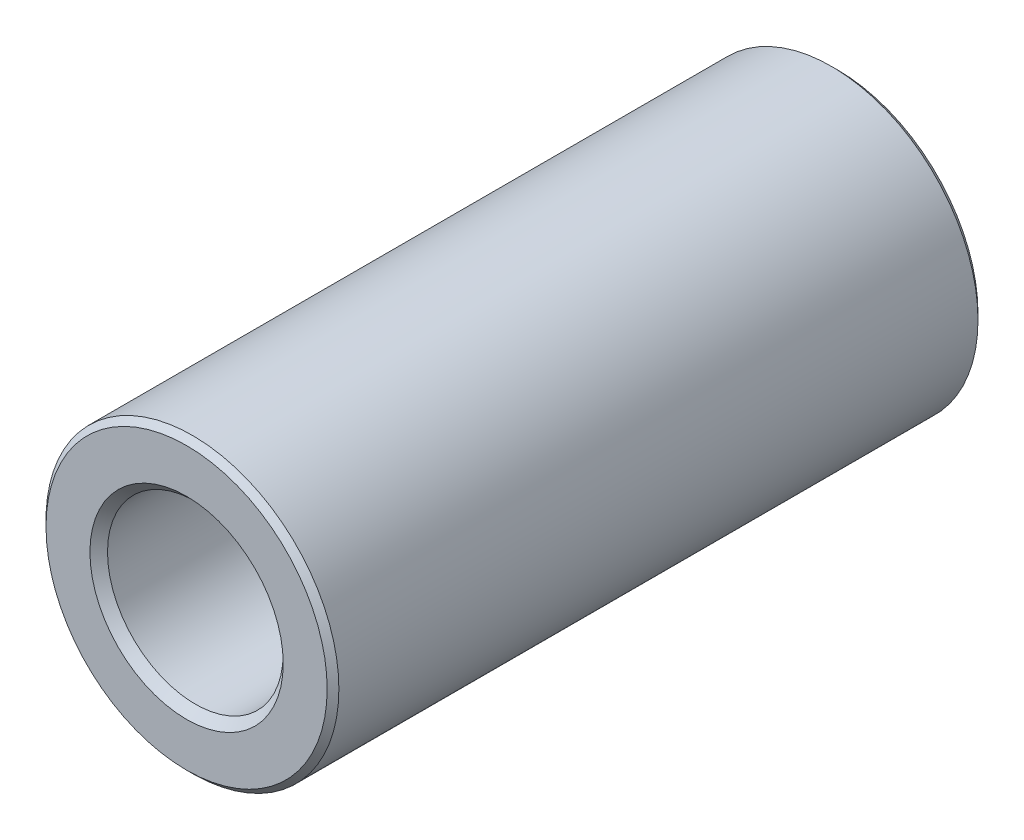
ISO-10303-21;
HEADER;
FILE_DESCRIPTION(('STEP AP214'),'2;1');
FILE_NAME('part.step','',(''),(''),'','','');
FILE_SCHEMA(('AUTOMOTIVE_DESIGN { 1 0 10303 214 1 1 1 1 }'));
ENDSEC;
DATA;
#1=APPLICATION_CONTEXT('core data for automotive mechanical design processes');
#2=APPLICATION_PROTOCOL_DEFINITION('international standard','automotive_design',2000,#1);
#3=PRODUCT_CONTEXT('',#1,'mechanical');
#4=PRODUCT('Part','Part','',(#3));
#5=PRODUCT_RELATED_PRODUCT_CATEGORY('part','',(#4));
#6=PRODUCT_DEFINITION_FORMATION('','',#4);
#7=PRODUCT_DEFINITION_CONTEXT('part definition',#1,'design');
#8=PRODUCT_DEFINITION('design','',#6,#7);
#9=PRODUCT_DEFINITION_SHAPE('','',#8);
#10=(LENGTH_UNIT() NAMED_UNIT(*) SI_UNIT(.MILLI.,.METRE.));
#11=(NAMED_UNIT(*) PLANE_ANGLE_UNIT() SI_UNIT($,.RADIAN.));
#12=(NAMED_UNIT(*) SI_UNIT($,.STERADIAN.) SOLID_ANGLE_UNIT());
#13=UNCERTAINTY_MEASURE_WITH_UNIT(LENGTH_MEASURE(1.E-05),#10,'distance_accuracy_value','');
#14=(GEOMETRIC_REPRESENTATION_CONTEXT(3) GLOBAL_UNCERTAINTY_ASSIGNED_CONTEXT((#13)) GLOBAL_UNIT_ASSIGNED_CONTEXT((#10,
#11,#12)) REPRESENTATION_CONTEXT('',''));
#15=CARTESIAN_POINT('',(0.,0.,0.));
#16=DIRECTION('',(0.,0.,1.));
#17=DIRECTION('',(1.,0.,0.));
#18=AXIS2_PLACEMENT_3D('',#15,#16,#17);
#19=CARTESIAN_POINT('',(0.,0.,-5.));
#20=DIRECTION('',(0.,0.,1.));
#21=DIRECTION('',(1.,0.,0.));
#22=AXIS2_PLACEMENT_3D('',#19,#20,#21);
#23=CYLINDRICAL_SURFACE('',#22,2.25);
#24=CARTESIAN_POINT('',(0.,0.,4.91));
#25=DIRECTION('',(0.,0.,1.));
#26=DIRECTION('',(1.,0.,0.));
#27=AXIS2_PLACEMENT_3D('',#24,#25,#26);
#28=CIRCLE('',#27,2.25);
#29=CARTESIAN_POINT('',(2.25,0.,4.91));
#30=VERTEX_POINT('',#29);
#31=EDGE_CURVE('E53',#30,#30,#28,.F.);
#32=ORIENTED_EDGE('',*,*,#31,.T.);
#33=EDGE_LOOP('',(#32));
#34=FACE_BOUND('',#33,.T.);
#35=CARTESIAN_POINT('',(0.,0.,-4.91));
#36=DIRECTION('',(0.,0.,1.));
#37=DIRECTION('',(1.,0.,0.));
#38=AXIS2_PLACEMENT_3D('',#35,#36,#37);
#39=CIRCLE('',#38,2.25);
#40=CARTESIAN_POINT('',(2.25,0.,-4.91));
#41=VERTEX_POINT('',#40);
#42=EDGE_CURVE('E56',#41,#41,#39,.T.);
#43=ORIENTED_EDGE('',*,*,#42,.T.);
#44=EDGE_LOOP('',(#43));
#45=FACE_BOUND('',#44,.T.);
#46=ADVANCED_FACE('F30',(#34,#45),#23,.T.);
#47=CARTESIAN_POINT('',(0.,0.,-5.));
#48=DIRECTION('',(0.,0.,1.));
#49=DIRECTION('',(1.,0.,0.));
#50=AXIS2_PLACEMENT_3D('',#47,#48,#49);
#51=PLANE('',#50);
#52=CARTESIAN_POINT('',(0.,0.,-5.));
#53=DIRECTION('',(0.,0.,1.));
#54=DIRECTION('',(1.,0.,0.));
#55=AXIS2_PLACEMENT_3D('',#52,#53,#54);
#56=CIRCLE('',#55,1.485);
#57=CARTESIAN_POINT('',(1.485,0.,-5.));
#58=VERTEX_POINT('',#57);
#59=EDGE_CURVE('E10',#58,#58,#56,.T.);
#60=ORIENTED_EDGE('',*,*,#59,.T.);
#61=EDGE_LOOP('',(#60));
#62=FACE_BOUND('',#61,.T.);
#63=CARTESIAN_POINT('',(0.,0.,-5.));
#64=DIRECTION('',(0.,0.,1.));
#65=DIRECTION('',(1.,0.,0.));
#66=AXIS2_PLACEMENT_3D('',#63,#64,#65);
#67=CIRCLE('',#66,2.16);
#68=CARTESIAN_POINT('',(2.16,0.,-5.));
#69=VERTEX_POINT('',#68);
#70=EDGE_CURVE('E50',#69,#69,#67,.F.);
#71=ORIENTED_EDGE('',*,*,#70,.T.);
#72=EDGE_LOOP('',(#71));
#73=FACE_BOUND('',#72,.T.);
#74=ADVANCED_FACE('F82',(#62,#73),#51,.F.);
#75=CARTESIAN_POINT('',(0.,0.,-5.));
#76=DIRECTION('',(0.,0.,1.));
#77=DIRECTION('',(1.,0.,0.));
#78=AXIS2_PLACEMENT_3D('',#75,#76,#77);
#79=CYLINDRICAL_SURFACE('',#78,1.35);
#80=CARTESIAN_POINT('',(0.,0.,4.865));
#81=DIRECTION('',(0.,0.,1.));
#82=DIRECTION('',(1.,0.,0.));
#83=AXIS2_PLACEMENT_3D('',#80,#81,#82);
#84=CIRCLE('',#83,1.35);
#85=CARTESIAN_POINT('',(1.35,0.,4.865));
#86=VERTEX_POINT('',#85);
#87=EDGE_CURVE('E41',#86,#86,#84,.T.);
#88=ORIENTED_EDGE('',*,*,#87,.T.);
#89=EDGE_LOOP('',(#88));
#90=FACE_BOUND('',#89,.T.);
#91=CARTESIAN_POINT('',(0.,0.,-4.865));
#92=DIRECTION('',(0.,0.,1.));
#93=DIRECTION('',(1.,0.,0.));
#94=AXIS2_PLACEMENT_3D('',#91,#92,#93);
#95=CIRCLE('',#94,1.35);
#96=CARTESIAN_POINT('',(1.35,0.,-4.865));
#97=VERTEX_POINT('',#96);
#98=EDGE_CURVE('E45',#97,#97,#95,.F.);
#99=ORIENTED_EDGE('',*,*,#98,.T.);
#100=EDGE_LOOP('',(#99));
#101=FACE_BOUND('',#100,.T.);
#102=ADVANCED_FACE('F77',(#90,#101),#79,.F.);
#103=CARTESIAN_POINT('',(0.,0.,5.));
#104=DIRECTION('',(0.,0.,1.));
#105=DIRECTION('',(1.,0.,0.));
#106=AXIS2_PLACEMENT_3D('',#103,#104,#105);
#107=PLANE('',#106);
#108=CARTESIAN_POINT('',(0.,0.,5.));
#109=DIRECTION('',(0.,0.,1.));
#110=DIRECTION('',(1.,0.,0.));
#111=AXIS2_PLACEMENT_3D('',#108,#109,#110);
#112=CIRCLE('',#111,1.485);
#113=CARTESIAN_POINT('',(1.485,0.,5.));
#114=VERTEX_POINT('',#113);
#115=EDGE_CURVE('E37',#114,#114,#112,.F.);
#116=ORIENTED_EDGE('',*,*,#115,.T.);
#117=EDGE_LOOP('',(#116));
#118=FACE_BOUND('',#117,.T.);
#119=CARTESIAN_POINT('',(0.,0.,5.));
#120=DIRECTION('',(0.,0.,1.));
#121=DIRECTION('',(1.,0.,0.));
#122=AXIS2_PLACEMENT_3D('',#119,#120,#121);
#123=CIRCLE('',#122,2.16);
#124=CARTESIAN_POINT('',(2.16,0.,5.));
#125=VERTEX_POINT('',#124);
#126=EDGE_CURVE('E59',#125,#125,#123,.T.);
#127=ORIENTED_EDGE('',*,*,#126,.T.);
#128=EDGE_LOOP('',(#127));
#129=FACE_BOUND('',#128,.T.);
#130=ADVANCED_FACE('F63',(#118,#129),#107,.T.);
#131=CARTESIAN_POINT('',(0.,0.,5.));
#132=DIRECTION('',(0.,0.,-1.));
#133=DIRECTION('',(-1.,0.,0.));
#134=AXIS2_PLACEMENT_3D('',#131,#132,#133);
#135=CONICAL_SURFACE('',#134,2.16,0.785398163397448);
#136=ORIENTED_EDGE('',*,*,#31,.F.);
#137=EDGE_LOOP('',(#136));
#138=FACE_BOUND('',#137,.T.);
#139=ORIENTED_EDGE('',*,*,#126,.F.);
#140=EDGE_LOOP('',(#139));
#141=FACE_BOUND('',#140,.T.);
#142=ADVANCED_FACE('F65',(#138,#141),#135,.T.);
#143=CARTESIAN_POINT('',(0.,0.,-4.91));
#144=DIRECTION('',(0.,0.,1.));
#145=DIRECTION('',(1.,0.,0.));
#146=AXIS2_PLACEMENT_3D('',#143,#144,#145);
#147=CONICAL_SURFACE('',#146,2.25,0.785398163397448);
#148=ORIENTED_EDGE('',*,*,#70,.F.);
#149=EDGE_LOOP('',(#148));
#150=FACE_BOUND('',#149,.T.);
#151=ORIENTED_EDGE('',*,*,#42,.F.);
#152=EDGE_LOOP('',(#151));
#153=FACE_BOUND('',#152,.T.);
#154=ADVANCED_FACE('F67',(#150,#153),#147,.T.);
#155=CARTESIAN_POINT('',(0.,0.,4.865));
#156=DIRECTION('',(0.,0.,1.));
#157=DIRECTION('',(1.,0.,0.));
#158=AXIS2_PLACEMENT_3D('',#155,#156,#157);
#159=CONICAL_SURFACE('',#158,1.35,0.785398163397456);
#160=ORIENTED_EDGE('',*,*,#115,.F.);
#161=EDGE_LOOP('',(#160));
#162=FACE_BOUND('',#161,.T.);
#163=ORIENTED_EDGE('',*,*,#87,.F.);
#164=EDGE_LOOP('',(#163));
#165=FACE_BOUND('',#164,.T.);
#166=ADVANCED_FACE('F74',(#162,#165),#159,.F.);
#167=CARTESIAN_POINT('',(0.,0.,-5.));
#168=DIRECTION('',(0.,0.,-1.));
#169=DIRECTION('',(-1.,0.,0.));
#170=AXIS2_PLACEMENT_3D('',#167,#168,#169);
#171=CONICAL_SURFACE('',#170,1.485,0.785398163397444);
#172=ORIENTED_EDGE('',*,*,#98,.F.);
#173=EDGE_LOOP('',(#172));
#174=FACE_BOUND('',#173,.T.);
#175=ORIENTED_EDGE('',*,*,#59,.F.);
#176=EDGE_LOOP('',(#175));
#177=FACE_BOUND('',#176,.T.);
#178=ADVANCED_FACE('F32',(#174,#177),#171,.F.);
#179=CLOSED_SHELL('',(#46,#74,#102,#130,#142,#154,#166,#178));
#180=MANIFOLD_SOLID_BREP('B2',#179);
#181=ADVANCED_BREP_SHAPE_REPRESENTATION('',(#18,#180),#14);
#182=SHAPE_DEFINITION_REPRESENTATION(#9,#181);
ENDSEC;
END-ISO-10303-21;
